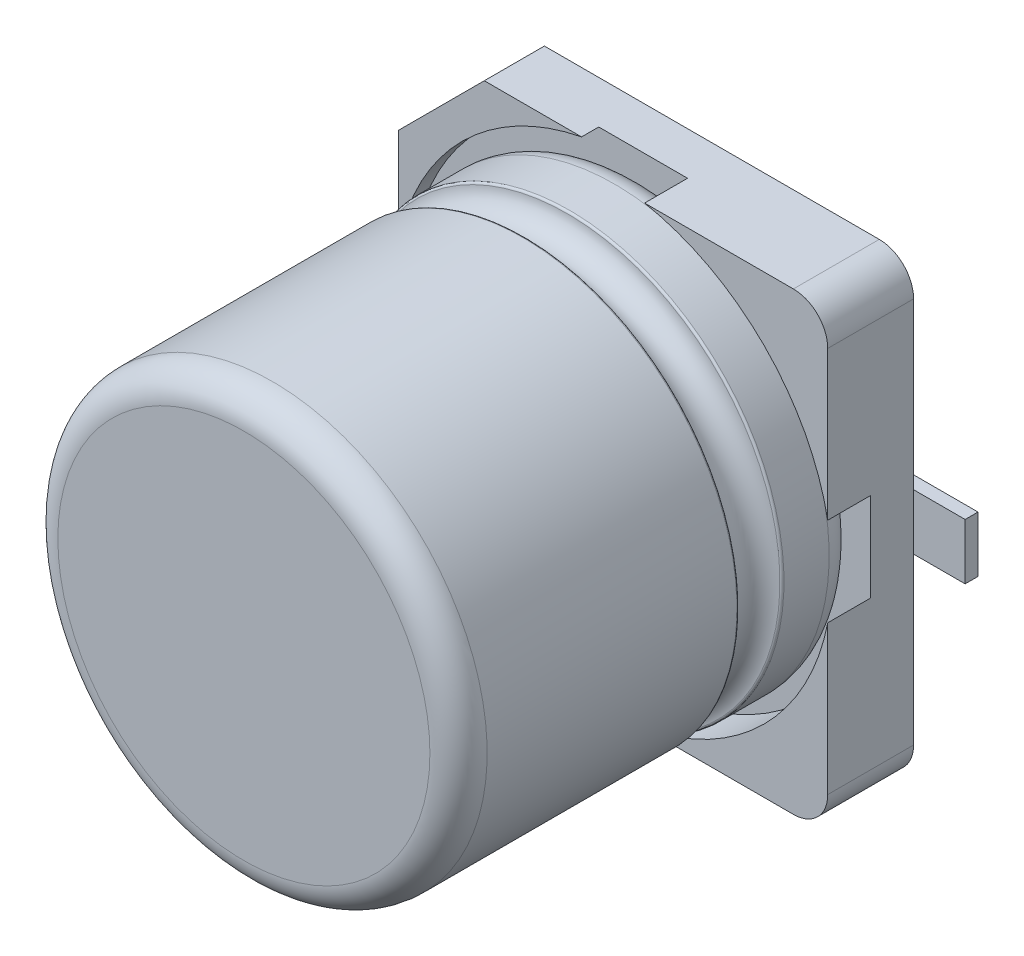
ISO-10303-21;
HEADER;
FILE_DESCRIPTION(('STEP AP214'),'2;1');
FILE_NAME('part.step','',(''),(''),'','','');
FILE_SCHEMA(('AUTOMOTIVE_DESIGN { 1 0 10303 214 1 1 1 1 }'));
ENDSEC;
DATA;
#1=APPLICATION_CONTEXT('core data for automotive mechanical design processes');
#2=APPLICATION_PROTOCOL_DEFINITION('international standard','automotive_design',2000,#1);
#3=PRODUCT_CONTEXT('',#1,'mechanical');
#4=PRODUCT('Part','Part','',(#3));
#5=PRODUCT_RELATED_PRODUCT_CATEGORY('part','',(#4));
#6=PRODUCT_DEFINITION_FORMATION('','',#4);
#7=PRODUCT_DEFINITION_CONTEXT('part definition',#1,'design');
#8=PRODUCT_DEFINITION('design','',#6,#7);
#9=PRODUCT_DEFINITION_SHAPE('','',#8);
#10=(LENGTH_UNIT() NAMED_UNIT(*) SI_UNIT(.MILLI.,.METRE.));
#11=(NAMED_UNIT(*) PLANE_ANGLE_UNIT() SI_UNIT($,.RADIAN.));
#12=(NAMED_UNIT(*) SI_UNIT($,.STERADIAN.) SOLID_ANGLE_UNIT());
#13=UNCERTAINTY_MEASURE_WITH_UNIT(LENGTH_MEASURE(1.E-05),#10,'distance_accuracy_value','');
#14=(GEOMETRIC_REPRESENTATION_CONTEXT(3) GLOBAL_UNCERTAINTY_ASSIGNED_CONTEXT((#13)) GLOBAL_UNIT_ASSIGNED_CONTEXT((#10,
#11,#12)) REPRESENTATION_CONTEXT('',''));
#15=CARTESIAN_POINT('',(0.,0.,0.));
#16=DIRECTION('',(0.,0.,1.));
#17=DIRECTION('',(1.,0.,0.));
#18=AXIS2_PLACEMENT_3D('',#15,#16,#17);
#19=CARTESIAN_POINT('',(0.,0.,5.3));
#20=DIRECTION('',(0.,0.,-1.));
#21=DIRECTION('',(0.,-1.,0.));
#22=AXIS2_PLACEMENT_3D('',#19,#20,#21);
#23=PLANE('',#22);
#24=CARTESIAN_POINT('',(0.,0.,5.30000000001));
#25=DIRECTION('',(0.,0.,-1.));
#26=DIRECTION('',(-1.,0.,0.));
#27=AXIS2_PLACEMENT_3D('',#24,#25,#26);
#28=CIRCLE('',#27,2.1666667);
#29=CARTESIAN_POINT('',(-2.166666666677,1.00002653401398E-11,5.30000000001));
#30=VERTEX_POINT('',#29);
#31=EDGE_CURVE('E11',#30,#30,#28,.T.);
#32=ORIENTED_EDGE('',*,*,#31,.F.);
#33=EDGE_LOOP('',(#32));
#34=FACE_BOUND('',#33,.T.);
#35=ADVANCED_FACE('F17',(#34),#23,.F.);
#36=CARTESIAN_POINT('',(2.072728390536,0.,0.));
#37=DIRECTION('',(0.,0.,1.));
#38=DIRECTION('',(1.,0.,0.));
#39=AXIS2_PLACEMENT_3D('',#36,#37,#38);
#40=PLANE('',#39);
#41=DIRECTION('',(1.,0.,0.));
#42=VECTOR('',#41,1.);
#43=CARTESIAN_POINT('',(1.07500000001,-0.32500000001,0.));
#44=LINE('',#43,#42);
#45=CARTESIAN_POINT('',(1.075,-0.325,0.));
#46=VERTEX_POINT('',#45);
#47=CARTESIAN_POINT('',(3.25,-0.325,0.));
#48=VERTEX_POINT('',#47);
#49=EDGE_CURVE('E545',#46,#48,#44,.T.);
#50=ORIENTED_EDGE('',*,*,#49,.F.);
#51=CARTESIAN_POINT('',(1.07500000001,-1.0000249421274E-11,0.));
#52=DIRECTION('',(0.,0.,1.));
#53=DIRECTION('',(0.,1.,0.));
#54=AXIS2_PLACEMENT_3D('',#51,#52,#53);
#55=CIRCLE('',#54,0.325);
#56=CARTESIAN_POINT('',(1.075,0.325,0.));
#57=VERTEX_POINT('',#56);
#58=EDGE_CURVE('E346',#57,#46,#55,.T.);
#59=ORIENTED_EDGE('',*,*,#58,.F.);
#60=DIRECTION('',(-1.,0.,0.));
#61=VECTOR('',#60,1.);
#62=CARTESIAN_POINT('',(3.25000000001,0.32500000001,0.));
#63=LINE('',#62,#61);
#64=CARTESIAN_POINT('',(3.25,0.325,0.));
#65=VERTEX_POINT('',#64);
#66=EDGE_CURVE('E351',#65,#57,#63,.T.);
#67=ORIENTED_EDGE('',*,*,#66,.F.);
#68=DIRECTION('',(0.,1.,0.));
#69=VECTOR('',#68,1.);
#70=CARTESIAN_POINT('',(3.25000000001,-0.32500000001,0.));
#71=LINE('',#70,#69);
#72=EDGE_CURVE('E30',#48,#65,#71,.T.);
#73=ORIENTED_EDGE('',*,*,#72,.F.);
#74=EDGE_LOOP('',(#50,#59,#67,#73));
#75=FACE_BOUND('',#74,.T.);
#76=ADVANCED_FACE('F677',(#75),#40,.F.);
#77=CARTESIAN_POINT('',(-2.072728390536,0.,0.));
#78=DIRECTION('',(0.,0.,1.));
#79=DIRECTION('',(1.,0.,0.));
#80=AXIS2_PLACEMENT_3D('',#77,#78,#79);
#81=PLANE('',#80);
#82=DIRECTION('',(-1.,0.,0.));
#83=VECTOR('',#82,1.);
#84=CARTESIAN_POINT('',(-1.07500000001,0.32500000001,0.));
#85=LINE('',#84,#83);
#86=CARTESIAN_POINT('',(-1.075,0.325,0.));
#87=VERTEX_POINT('',#86);
#88=CARTESIAN_POINT('',(-3.25,0.325,0.));
#89=VERTEX_POINT('',#88);
#90=EDGE_CURVE('E331',#87,#89,#85,.T.);
#91=ORIENTED_EDGE('',*,*,#90,.F.);
#92=CARTESIAN_POINT('',(-1.07500000001,1.00001177717431E-11,0.));
#93=DIRECTION('',(0.,0.,1.));
#94=DIRECTION('',(0.,-1.,0.));
#95=AXIS2_PLACEMENT_3D('',#92,#93,#94);
#96=CIRCLE('',#95,0.325);
#97=CARTESIAN_POINT('',(-1.075,-0.325,0.));
#98=VERTEX_POINT('',#97);
#99=EDGE_CURVE('E329',#98,#87,#96,.T.);
#100=ORIENTED_EDGE('',*,*,#99,.F.);
#101=DIRECTION('',(1.,0.,0.));
#102=VECTOR('',#101,1.);
#103=CARTESIAN_POINT('',(-3.25000000001,-0.32500000001,0.));
#104=LINE('',#103,#102);
#105=CARTESIAN_POINT('',(-3.25,-0.325,0.));
#106=VERTEX_POINT('',#105);
#107=EDGE_CURVE('E522',#106,#98,#104,.T.);
#108=ORIENTED_EDGE('',*,*,#107,.F.);
#109=DIRECTION('',(0.,-1.,0.));
#110=VECTOR('',#109,1.);
#111=CARTESIAN_POINT('',(-3.25000000001,0.32500000001,0.));
#112=LINE('',#111,#110);
#113=EDGE_CURVE('E472',#89,#106,#112,.T.);
#114=ORIENTED_EDGE('',*,*,#113,.F.);
#115=EDGE_LOOP('',(#91,#100,#108,#114));
#116=FACE_BOUND('',#115,.T.);
#117=ADVANCED_FACE('F500',(#116),#81,.F.);
#118=CARTESIAN_POINT('',(0.,0.,4.966666666667));
#119=DIRECTION('',(0.,0.,1.));
#120=DIRECTION('',(-1.,0.,0.));
#121=AXIS2_PLACEMENT_3D('',#118,#119,#120);
#122=TOROIDAL_SURFACE('',#121,2.1666667,0.3333333);
#123=ORIENTED_EDGE('',*,*,#31,.T.);
#124=EDGE_LOOP('',(#123));
#125=FACE_BOUND('',#124,.T.);
#126=CARTESIAN_POINT('',(0.,0.,4.966666666677));
#127=DIRECTION('',(0.,0.,-1.));
#128=DIRECTION('',(-1.,0.,0.));
#129=AXIS2_PLACEMENT_3D('',#126,#127,#128);
#130=CIRCLE('',#129,2.5);
#131=CARTESIAN_POINT('',(-2.50000000001,1.00003061616998E-11,4.966666666677));
#132=VERTEX_POINT('',#131);
#133=EDGE_CURVE('E623',#132,#132,#130,.T.);
#134=ORIENTED_EDGE('',*,*,#133,.F.);
#135=EDGE_LOOP('',(#134));
#136=FACE_BOUND('',#135,.T.);
#137=ADVANCED_FACE('F691',(#125,#136),#122,.T.);
#138=CARTESIAN_POINT('',(3.25,-0.325,0.));
#139=DIRECTION('',(-1.,0.,0.));
#140=DIRECTION('',(0.,0.,1.));
#141=AXIS2_PLACEMENT_3D('',#138,#139,#140);
#142=PLANE('',#141);
#143=ORIENTED_EDGE('',*,*,#72,.T.);
#144=DIRECTION('',(0.,0.,1.));
#145=VECTOR('',#144,1.);
#146=CARTESIAN_POINT('',(3.25000000001,0.32500000001,0.));
#147=LINE('',#146,#145);
#148=CARTESIAN_POINT('',(3.25,0.325,0.15));
#149=VERTEX_POINT('',#148);
#150=EDGE_CURVE('E181',#65,#149,#147,.T.);
#151=ORIENTED_EDGE('',*,*,#150,.T.);
#152=DIRECTION('',(0.,1.,0.));
#153=VECTOR('',#152,1.);
#154=CARTESIAN_POINT('',(3.25000000001,-0.32500000001,0.15000000001));
#155=LINE('',#154,#153);
#156=CARTESIAN_POINT('',(3.25,-0.325,0.15));
#157=VERTEX_POINT('',#156);
#158=EDGE_CURVE('E468',#157,#149,#155,.T.);
#159=ORIENTED_EDGE('',*,*,#158,.F.);
#160=DIRECTION('',(0.,0.,1.));
#161=VECTOR('',#160,1.);
#162=CARTESIAN_POINT('',(3.25000000001,-0.32500000001,0.));
#163=LINE('',#162,#161);
#164=EDGE_CURVE('E171',#48,#157,#163,.T.);
#165=ORIENTED_EDGE('',*,*,#164,.F.);
#166=EDGE_LOOP('',(#143,#151,#159,#165));
#167=FACE_BOUND('',#166,.T.);
#168=ADVANCED_FACE('F689',(#167),#142,.F.);
#169=CARTESIAN_POINT('',(-3.25,0.325,0.));
#170=DIRECTION('',(1.,0.,0.));
#171=DIRECTION('',(0.,-1.,0.));
#172=AXIS2_PLACEMENT_3D('',#169,#170,#171);
#173=PLANE('',#172);
#174=ORIENTED_EDGE('',*,*,#113,.T.);
#175=DIRECTION('',(0.,0.,1.));
#176=VECTOR('',#175,1.);
#177=CARTESIAN_POINT('',(-3.25000000001,-0.32500000001,0.));
#178=LINE('',#177,#176);
#179=CARTESIAN_POINT('',(-3.25,-0.325,0.15));
#180=VERTEX_POINT('',#179);
#181=EDGE_CURVE('E429',#106,#180,#178,.T.);
#182=ORIENTED_EDGE('',*,*,#181,.T.);
#183=DIRECTION('',(0.,-1.,0.));
#184=VECTOR('',#183,1.);
#185=CARTESIAN_POINT('',(-3.25000000001,0.32500000001,0.15000000001));
#186=LINE('',#185,#184);
#187=CARTESIAN_POINT('',(-3.25,0.325,0.15));
#188=VERTEX_POINT('',#187);
#189=EDGE_CURVE('E382',#188,#180,#186,.T.);
#190=ORIENTED_EDGE('',*,*,#189,.F.);
#191=DIRECTION('',(0.,0.,1.));
#192=VECTOR('',#191,1.);
#193=CARTESIAN_POINT('',(-3.25000000001,0.32500000001,0.));
#194=LINE('',#193,#192);
#195=EDGE_CURVE('E334',#89,#188,#194,.T.);
#196=ORIENTED_EDGE('',*,*,#195,.F.);
#197=EDGE_LOOP('',(#174,#182,#190,#196));
#198=FACE_BOUND('',#197,.T.);
#199=ADVANCED_FACE('F659',(#198),#173,.F.);
#200=CARTESIAN_POINT('',(1.075,-0.325,0.));
#201=DIRECTION('',(0.,1.,0.));
#202=DIRECTION('',(0.,0.,-1.));
#203=AXIS2_PLACEMENT_3D('',#200,#201,#202);
#204=PLANE('',#203);
#205=ORIENTED_EDGE('',*,*,#49,.T.);
#206=ORIENTED_EDGE('',*,*,#164,.T.);
#207=DIRECTION('',(1.,0.,0.));
#208=VECTOR('',#207,1.);
#209=CARTESIAN_POINT('',(1.07500000001,-0.32500000001,0.15000000001));
#210=LINE('',#209,#208);
#211=CARTESIAN_POINT('',(2.65,-0.325,0.15));
#212=VERTEX_POINT('',#211);
#213=EDGE_CURVE('E464',#212,#157,#210,.T.);
#214=ORIENTED_EDGE('',*,*,#213,.F.);
#215=DIRECTION('',(1.,0.,0.));
#216=VECTOR('',#215,1.);
#217=CARTESIAN_POINT('',(1.07500000001,-0.32500000001,0.15000000001));
#218=LINE('',#217,#216);
#219=CARTESIAN_POINT('',(1.075,-0.325,0.15));
#220=VERTEX_POINT('',#219);
#221=EDGE_CURVE('E366',#220,#212,#218,.T.);
#222=ORIENTED_EDGE('',*,*,#221,.F.);
#223=DIRECTION('',(0.,0.,1.));
#224=VECTOR('',#223,1.);
#225=CARTESIAN_POINT('',(1.07500000001,-0.32500000001,0.));
#226=LINE('',#225,#224);
#227=EDGE_CURVE('E350',#46,#220,#226,.T.);
#228=ORIENTED_EDGE('',*,*,#227,.F.);
#229=EDGE_LOOP('',(#205,#206,#214,#222,#228));
#230=FACE_BOUND('',#229,.T.);
#231=ADVANCED_FACE('F796',(#230),#204,.F.);
#232=CARTESIAN_POINT('',(1.075,0.,0.));
#233=DIRECTION('',(0.,0.,1.));
#234=DIRECTION('',(0.,1.,0.));
#235=AXIS2_PLACEMENT_3D('',#232,#233,#234);
#236=CYLINDRICAL_SURFACE('',#235,0.325);
#237=ORIENTED_EDGE('',*,*,#58,.T.);
#238=ORIENTED_EDGE('',*,*,#227,.T.);
#239=CARTESIAN_POINT('',(1.07500000001,-1.0000249421274E-11,0.15000000001));
#240=DIRECTION('',(0.,0.,1.));
#241=DIRECTION('',(0.,1.,0.));
#242=AXIS2_PLACEMENT_3D('',#239,#240,#241);
#243=CIRCLE('',#242,0.325);
#244=CARTESIAN_POINT('',(1.075,0.325,0.15));
#245=VERTEX_POINT('',#244);
#246=EDGE_CURVE('E371',#245,#220,#243,.T.);
#247=ORIENTED_EDGE('',*,*,#246,.F.);
#248=DIRECTION('',(0.,0.,1.));
#249=VECTOR('',#248,1.);
#250=CARTESIAN_POINT('',(1.07500000001,0.32500000001,0.));
#251=LINE('',#250,#249);
#252=EDGE_CURVE('E355',#57,#245,#251,.T.);
#253=ORIENTED_EDGE('',*,*,#252,.F.);
#254=EDGE_LOOP('',(#237,#238,#247,#253));
#255=FACE_BOUND('',#254,.T.);
#256=ADVANCED_FACE('F671',(#255),#236,.T.);
#257=CARTESIAN_POINT('',(3.25,0.325,0.));
#258=DIRECTION('',(0.,-1.,0.));
#259=DIRECTION('',(-1.,0.,0.));
#260=AXIS2_PLACEMENT_3D('',#257,#258,#259);
#261=PLANE('',#260);
#262=ORIENTED_EDGE('',*,*,#66,.T.);
#263=ORIENTED_EDGE('',*,*,#252,.T.);
#264=DIRECTION('',(-1.,0.,0.));
#265=VECTOR('',#264,1.);
#266=CARTESIAN_POINT('',(3.25000000001,0.32500000001,0.15000000001));
#267=LINE('',#266,#265);
#268=CARTESIAN_POINT('',(2.65,0.325,0.15));
#269=VERTEX_POINT('',#268);
#270=EDGE_CURVE('E456',#269,#245,#267,.T.);
#271=ORIENTED_EDGE('',*,*,#270,.F.);
#272=DIRECTION('',(-1.,0.,0.));
#273=VECTOR('',#272,1.);
#274=CARTESIAN_POINT('',(3.25000000001,0.32500000001,0.15000000001));
#275=LINE('',#274,#273);
#276=EDGE_CURVE('E620',#149,#269,#275,.T.);
#277=ORIENTED_EDGE('',*,*,#276,.F.);
#278=ORIENTED_EDGE('',*,*,#150,.F.);
#279=EDGE_LOOP('',(#262,#263,#271,#277,#278));
#280=FACE_BOUND('',#279,.T.);
#281=ADVANCED_FACE('F663',(#280),#261,.F.);
#282=CARTESIAN_POINT('',(-1.075,0.325,0.));
#283=DIRECTION('',(0.,-1.,0.));
#284=DIRECTION('',(-1.,0.,0.));
#285=AXIS2_PLACEMENT_3D('',#282,#283,#284);
#286=PLANE('',#285);
#287=ORIENTED_EDGE('',*,*,#90,.T.);
#288=ORIENTED_EDGE('',*,*,#195,.T.);
#289=DIRECTION('',(-1.,0.,0.));
#290=VECTOR('',#289,1.);
#291=CARTESIAN_POINT('',(-1.07500000001,0.32500000001,0.15000000001));
#292=LINE('',#291,#290);
#293=CARTESIAN_POINT('',(-2.65,0.325,0.15));
#294=VERTEX_POINT('',#293);
#295=EDGE_CURVE('E406',#294,#188,#292,.T.);
#296=ORIENTED_EDGE('',*,*,#295,.F.);
#297=DIRECTION('',(-1.,0.,0.));
#298=VECTOR('',#297,1.);
#299=CARTESIAN_POINT('',(-1.07500000001,0.32500000001,0.15000000001));
#300=LINE('',#299,#298);
#301=CARTESIAN_POINT('',(-1.075,0.325,0.15));
#302=VERTEX_POINT('',#301);
#303=EDGE_CURVE('E300',#302,#294,#300,.T.);
#304=ORIENTED_EDGE('',*,*,#303,.F.);
#305=DIRECTION('',(0.,0.,1.));
#306=VECTOR('',#305,1.);
#307=CARTESIAN_POINT('',(-1.07500000001,0.32500000001,0.));
#308=LINE('',#307,#306);
#309=EDGE_CURVE('E335',#87,#302,#308,.T.);
#310=ORIENTED_EDGE('',*,*,#309,.F.);
#311=EDGE_LOOP('',(#287,#288,#296,#304,#310));
#312=FACE_BOUND('',#311,.T.);
#313=ADVANCED_FACE('F661',(#312),#286,.F.);
#314=CARTESIAN_POINT('',(-1.075,0.,0.));
#315=DIRECTION('',(0.,0.,1.));
#316=DIRECTION('',(0.,-1.,0.));
#317=AXIS2_PLACEMENT_3D('',#314,#315,#316);
#318=CYLINDRICAL_SURFACE('',#317,0.325);
#319=ORIENTED_EDGE('',*,*,#99,.T.);
#320=ORIENTED_EDGE('',*,*,#309,.T.);
#321=CARTESIAN_POINT('',(-1.07500000001,1.00001177717431E-11,0.15000000001));
#322=DIRECTION('',(0.,0.,1.));
#323=DIRECTION('',(0.,-1.,0.));
#324=AXIS2_PLACEMENT_3D('',#321,#322,#323);
#325=CIRCLE('',#324,0.325);
#326=CARTESIAN_POINT('',(-1.075,-0.325,0.15));
#327=VERTEX_POINT('',#326);
#328=EDGE_CURVE('E342',#327,#302,#325,.T.);
#329=ORIENTED_EDGE('',*,*,#328,.F.);
#330=DIRECTION('',(0.,0.,1.));
#331=VECTOR('',#330,1.);
#332=CARTESIAN_POINT('',(-1.07500000001,-0.32500000001,0.));
#333=LINE('',#332,#331);
#334=EDGE_CURVE('E432',#98,#327,#333,.T.);
#335=ORIENTED_EDGE('',*,*,#334,.F.);
#336=EDGE_LOOP('',(#319,#320,#329,#335));
#337=FACE_BOUND('',#336,.T.);
#338=ADVANCED_FACE('F653',(#337),#318,.T.);
#339=CARTESIAN_POINT('',(-3.25,-0.325,0.));
#340=DIRECTION('',(0.,1.,0.));
#341=DIRECTION('',(0.,0.,-1.));
#342=AXIS2_PLACEMENT_3D('',#339,#340,#341);
#343=PLANE('',#342);
#344=ORIENTED_EDGE('',*,*,#107,.T.);
#345=ORIENTED_EDGE('',*,*,#334,.T.);
#346=DIRECTION('',(1.,0.,0.));
#347=VECTOR('',#346,1.);
#348=CARTESIAN_POINT('',(-3.25000000001,-0.32500000001,0.15000000001));
#349=LINE('',#348,#347);
#350=CARTESIAN_POINT('',(-2.65,-0.325,0.15));
#351=VERTEX_POINT('',#350);
#352=EDGE_CURVE('E345',#351,#327,#349,.T.);
#353=ORIENTED_EDGE('',*,*,#352,.F.);
#354=DIRECTION('',(1.,0.,0.));
#355=VECTOR('',#354,1.);
#356=CARTESIAN_POINT('',(-3.25000000001,-0.32500000001,0.15000000001));
#357=LINE('',#356,#355);
#358=EDGE_CURVE('E378',#180,#351,#357,.T.);
#359=ORIENTED_EDGE('',*,*,#358,.F.);
#360=ORIENTED_EDGE('',*,*,#181,.F.);
#361=EDGE_LOOP('',(#344,#345,#353,#359,#360));
#362=FACE_BOUND('',#361,.T.);
#363=ADVANCED_FACE('F643',(#362),#343,.F.);
#364=CARTESIAN_POINT('',(0.,0.,2.033333333333));
#365=DIRECTION('',(0.,0.,-1.));
#366=DIRECTION('',(-1.,0.,0.));
#367=AXIS2_PLACEMENT_3D('',#364,#365,#366);
#368=CYLINDRICAL_SURFACE('',#367,2.5);
#369=ORIENTED_EDGE('',*,*,#133,.T.);
#370=EDGE_LOOP('',(#369));
#371=FACE_BOUND('',#370,.T.);
#372=CARTESIAN_POINT('',(0.,0.,2.05719461208594));
#373=DIRECTION('',(0.,0.,-1.));
#374=DIRECTION('',(-1.,-4.06553765769633E-12,0.));
#375=AXIS2_PLACEMENT_3D('',#372,#373,#374);
#376=CIRCLE('',#375,2.49998919053012);
#377=CARTESIAN_POINT('',(-2.49998936936848,-1.01622350905833E-11,2.057194612086));
#378=VERTEX_POINT('',#377);
#379=EDGE_CURVE('E359',#378,#378,#376,.T.);
#380=ORIENTED_EDGE('',*,*,#379,.F.);
#381=EDGE_LOOP('',(#380));
#382=FACE_BOUND('',#381,.T.);
#383=ADVANCED_FACE('F719',(#371,#382),#368,.T.);
#384=CARTESIAN_POINT('',(2.072728390536,0.,0.15));
#385=DIRECTION('',(0.,0.,1.));
#386=DIRECTION('',(1.,0.,0.));
#387=AXIS2_PLACEMENT_3D('',#384,#385,#386);
#388=PLANE('',#387);
#389=ORIENTED_EDGE('',*,*,#213,.T.);
#390=ORIENTED_EDGE('',*,*,#158,.T.);
#391=ORIENTED_EDGE('',*,*,#276,.T.);
#392=DIRECTION('',(0.,1.,0.));
#393=VECTOR('',#392,1.);
#394=CARTESIAN_POINT('',(2.65000000001,-2.65000000001,0.15000000001));
#395=LINE('',#394,#393);
#396=EDGE_CURVE('E445',#212,#269,#395,.T.);
#397=ORIENTED_EDGE('',*,*,#396,.F.);
#398=EDGE_LOOP('',(#389,#390,#391,#397));
#399=FACE_BOUND('',#398,.T.);
#400=ADVANCED_FACE('F856',(#399),#388,.T.);
#401=CARTESIAN_POINT('',(0.175694359816,0.,1.15));
#402=DIRECTION('',(0.,0.,1.));
#403=DIRECTION('',(0.,-1.,0.));
#404=AXIS2_PLACEMENT_3D('',#401,#402,#403);
#405=PLANE('',#404);
#406=CARTESIAN_POINT('',(2.25000000001,-2.25000000001,1.15000000001));
#407=DIRECTION('',(0.,0.,-1.));
#408=DIRECTION('',(0.,1.,0.));
#409=AXIS2_PLACEMENT_3D('',#406,#407,#408);
#410=CIRCLE('',#409,0.4);
#411=CARTESIAN_POINT('',(2.65,-2.25,1.15));
#412=VERTEX_POINT('',#411);
#413=CARTESIAN_POINT('',(2.25,-2.65,1.15));
#414=VERTEX_POINT('',#413);
#415=EDGE_CURVE('E469',#412,#414,#410,.T.);
#416=ORIENTED_EDGE('',*,*,#415,.F.);
#417=DIRECTION('',(0.,1.,0.));
#418=VECTOR('',#417,1.);
#419=CARTESIAN_POINT('',(2.65000000001,-2.65000000001,1.15000000001));
#420=LINE('',#419,#418);
#421=CARTESIAN_POINT('',(2.65,-0.517204021639,1.15));
#422=VERTEX_POINT('',#421);
#423=EDGE_CURVE('E388',#412,#422,#420,.T.);
#424=ORIENTED_EDGE('',*,*,#423,.T.);
#425=CARTESIAN_POINT('',(0.,0.,1.15000000001));
#426=DIRECTION('',(0.,0.,1.));
#427=DIRECTION('',(-1.,0.,0.));
#428=AXIS2_PLACEMENT_3D('',#425,#426,#427);
#429=CIRCLE('',#428,2.7);
#430=CARTESIAN_POINT('',(0.517204021639,-2.65,1.15));
#431=VERTEX_POINT('',#430);
#432=EDGE_CURVE('E336',#431,#422,#429,.T.);
#433=ORIENTED_EDGE('',*,*,#432,.F.);
#434=DIRECTION('',(1.,0.,0.));
#435=VECTOR('',#434,1.);
#436=CARTESIAN_POINT('',(-1.65000000001,-2.65000000001,1.15000000001));
#437=LINE('',#436,#435);
#438=EDGE_CURVE('E512',#431,#414,#437,.T.);
#439=ORIENTED_EDGE('',*,*,#438,.T.);
#440=EDGE_LOOP('',(#416,#424,#433,#439));
#441=FACE_BOUND('',#440,.T.);
#442=ADVANCED_FACE('F842',(#441),#405,.T.);
#443=CARTESIAN_POINT('',(2.25,-2.25,0.15));
#444=DIRECTION('',(0.,0.,-1.));
#445=DIRECTION('',(1.,0.,0.));
#446=AXIS2_PLACEMENT_3D('',#443,#444,#445);
#447=CYLINDRICAL_SURFACE('',#446,0.4);
#448=DIRECTION('',(0.,0.,1.));
#449=VECTOR('',#448,1.);
#450=CARTESIAN_POINT('',(2.65000000001,-2.25000000001,0.15000000001));
#451=LINE('',#450,#449);
#452=CARTESIAN_POINT('',(2.65,-2.25,0.15));
#453=VERTEX_POINT('',#452);
#454=EDGE_CURVE('E383',#453,#412,#451,.T.);
#455=ORIENTED_EDGE('',*,*,#454,.T.);
#456=ORIENTED_EDGE('',*,*,#415,.T.);
#457=DIRECTION('',(0.,0.,1.));
#458=VECTOR('',#457,1.);
#459=CARTESIAN_POINT('',(2.25000000001,-2.65000000001,0.15000000001));
#460=LINE('',#459,#458);
#461=CARTESIAN_POINT('',(2.25,-2.65,0.15));
#462=VERTEX_POINT('',#461);
#463=EDGE_CURVE('E397',#462,#414,#460,.T.);
#464=ORIENTED_EDGE('',*,*,#463,.F.);
#465=CARTESIAN_POINT('',(2.25000000001,-2.25000000001,0.15000000001));
#466=DIRECTION('',(0.,0.,-1.));
#467=DIRECTION('',(0.,1.,0.));
#468=AXIS2_PLACEMENT_3D('',#465,#466,#467);
#469=CIRCLE('',#468,0.4);
#470=EDGE_CURVE('E370',#453,#462,#469,.T.);
#471=ORIENTED_EDGE('',*,*,#470,.F.);
#472=EDGE_LOOP('',(#455,#456,#464,#471));
#473=FACE_BOUND('',#472,.T.);
#474=ADVANCED_FACE('F502',(#473),#447,.T.);
#475=CARTESIAN_POINT('',(2.25,2.25,0.15));
#476=DIRECTION('',(0.,0.,-1.));
#477=DIRECTION('',(0.,1.,0.));
#478=AXIS2_PLACEMENT_3D('',#475,#476,#477);
#479=CYLINDRICAL_SURFACE('',#478,0.4);
#480=DIRECTION('',(0.,0.,1.));
#481=VECTOR('',#480,1.);
#482=CARTESIAN_POINT('',(2.25000000001,2.65000000001,0.15000000001));
#483=LINE('',#482,#481);
#484=CARTESIAN_POINT('',(2.25,2.65,0.15));
#485=VERTEX_POINT('',#484);
#486=CARTESIAN_POINT('',(2.25,2.65,1.15));
#487=VERTEX_POINT('',#486);
#488=EDGE_CURVE('E541',#485,#487,#483,.T.);
#489=ORIENTED_EDGE('',*,*,#488,.T.);
#490=CARTESIAN_POINT('',(2.25000000001,2.25000000001,1.15000000001));
#491=DIRECTION('',(0.,0.,-1.));
#492=DIRECTION('',(0.,1.,0.));
#493=AXIS2_PLACEMENT_3D('',#490,#491,#492);
#494=CIRCLE('',#493,0.4);
#495=CARTESIAN_POINT('',(2.65,2.25,1.15));
#496=VERTEX_POINT('',#495);
#497=EDGE_CURVE('E416',#487,#496,#494,.T.);
#498=ORIENTED_EDGE('',*,*,#497,.T.);
#499=DIRECTION('',(0.,0.,1.));
#500=VECTOR('',#499,1.);
#501=CARTESIAN_POINT('',(2.65000000001,2.25000000001,0.15000000001));
#502=LINE('',#501,#500);
#503=CARTESIAN_POINT('',(2.65,2.25,0.15));
#504=VERTEX_POINT('',#503);
#505=EDGE_CURVE('E586',#504,#496,#502,.T.);
#506=ORIENTED_EDGE('',*,*,#505,.F.);
#507=CARTESIAN_POINT('',(2.25000000001,2.25000000001,0.15000000001));
#508=DIRECTION('',(0.,0.,-1.));
#509=DIRECTION('',(0.,1.,0.));
#510=AXIS2_PLACEMENT_3D('',#507,#508,#509);
#511=CIRCLE('',#510,0.4);
#512=EDGE_CURVE('E299',#485,#504,#511,.T.);
#513=ORIENTED_EDGE('',*,*,#512,.F.);
#514=EDGE_LOOP('',(#489,#498,#506,#513));
#515=FACE_BOUND('',#514,.T.);
#516=ADVANCED_FACE('F19',(#515),#479,.T.);
#517=CARTESIAN_POINT('',(0.175694359816,0.,1.15));
#518=DIRECTION('',(0.,0.,1.));
#519=DIRECTION('',(0.,-1.,0.));
#520=AXIS2_PLACEMENT_3D('',#517,#518,#519);
#521=PLANE('',#520);
#522=CARTESIAN_POINT('',(0.,0.,1.15000000001));
#523=DIRECTION('',(0.,0.,1.));
#524=DIRECTION('',(-1.,0.,0.));
#525=AXIS2_PLACEMENT_3D('',#522,#523,#524);
#526=CIRCLE('',#525,2.7);
#527=CARTESIAN_POINT('',(2.65,0.517204021639,1.15));
#528=VERTEX_POINT('',#527);
#529=CARTESIAN_POINT('',(0.517204021639,2.65,1.15));
#530=VERTEX_POINT('',#529);
#531=EDGE_CURVE('E341',#528,#530,#526,.T.);
#532=ORIENTED_EDGE('',*,*,#531,.F.);
#533=DIRECTION('',(0.,1.,0.));
#534=VECTOR('',#533,1.);
#535=CARTESIAN_POINT('',(2.65000000001,-2.65000000001,1.15000000001));
#536=LINE('',#535,#534);
#537=EDGE_CURVE('E402',#528,#496,#536,.T.);
#538=ORIENTED_EDGE('',*,*,#537,.T.);
#539=ORIENTED_EDGE('',*,*,#497,.F.);
#540=DIRECTION('',(-1.,0.,0.));
#541=VECTOR('',#540,1.);
#542=CARTESIAN_POINT('',(2.65000000001,2.65000000001,1.15000000001));
#543=LINE('',#542,#541);
#544=EDGE_CURVE('E537',#487,#530,#543,.T.);
#545=ORIENTED_EDGE('',*,*,#544,.T.);
#546=EDGE_LOOP('',(#532,#538,#539,#545));
#547=FACE_BOUND('',#546,.T.);
#548=ADVANCED_FACE('F805',(#547),#521,.T.);
#549=CARTESIAN_POINT('',(0.,2.65,0.85));
#550=DIRECTION('',(0.,0.,1.));
#551=DIRECTION('',(1.,0.,0.));
#552=AXIS2_PLACEMENT_3D('',#549,#550,#551);
#553=PLANE('',#552);
#554=DIRECTION('',(-1.,0.,0.));
#555=VECTOR('',#554,1.);
#556=CARTESIAN_POINT('',(-1.00003245314018E-11,-2.65000000001,0.85000000001));
#557=LINE('',#556,#555);
#558=CARTESIAN_POINT('',(-0.517204021639,-2.65,0.85));
#559=VERTEX_POINT('',#558);
#560=CARTESIAN_POINT('',(-1.65,-2.65,0.85));
#561=VERTEX_POINT('',#560);
#562=EDGE_CURVE('E450',#559,#561,#557,.T.);
#563=ORIENTED_EDGE('',*,*,#562,.F.);
#564=CARTESIAN_POINT('',(0.,0.,0.85000000001));
#565=DIRECTION('',(0.,0.,-1.));
#566=DIRECTION('',(-1.,0.,0.));
#567=AXIS2_PLACEMENT_3D('',#564,#565,#566);
#568=CIRCLE('',#567,2.7);
#569=CARTESIAN_POINT('',(-2.65,-0.517204021639,0.85));
#570=VERTEX_POINT('',#569);
#571=EDGE_CURVE('E412',#559,#570,#568,.T.);
#572=ORIENTED_EDGE('',*,*,#571,.T.);
#573=DIRECTION('',(0.,-1.,0.));
#574=VECTOR('',#573,1.);
#575=CARTESIAN_POINT('',(-2.65000000001,2.65000000001,0.85000000001));
#576=LINE('',#575,#574);
#577=CARTESIAN_POINT('',(-2.65,-1.65,0.85));
#578=VERTEX_POINT('',#577);
#579=EDGE_CURVE('E372',#570,#578,#576,.T.);
#580=ORIENTED_EDGE('',*,*,#579,.T.);
#581=DIRECTION('',(0.707106781186548,-0.707106781186548,0.));
#582=VECTOR('',#581,1.);
#583=CARTESIAN_POINT('',(-3.06250000001,-1.23750000001,0.85000000001));
#584=LINE('',#583,#582);
#585=EDGE_CURVE('E381',#578,#561,#584,.T.);
#586=ORIENTED_EDGE('',*,*,#585,.T.);
#587=EDGE_LOOP('',(#563,#572,#580,#586));
#588=FACE_BOUND('',#587,.T.);
#589=ADVANCED_FACE('F807',(#588),#553,.T.);
#590=CARTESIAN_POINT('',(-2.65,-1.65,0.15));
#591=DIRECTION('',(0.707106781186548,0.707106781186548,0.));
#592=DIRECTION('',(0.,0.,-1.));
#593=AXIS2_PLACEMENT_3D('',#590,#591,#592);
#594=PLANE('',#593);
#595=DIRECTION('',(0.,0.,1.));
#596=VECTOR('',#595,1.);
#597=CARTESIAN_POINT('',(-1.65000000001,-2.65000000001,0.15000000001));
#598=LINE('',#597,#596);
#599=CARTESIAN_POINT('',(-1.65,-2.65,0.15));
#600=VERTEX_POINT('',#599);
#601=EDGE_CURVE('E454',#600,#561,#598,.T.);
#602=ORIENTED_EDGE('',*,*,#601,.T.);
#603=ORIENTED_EDGE('',*,*,#585,.F.);
#604=DIRECTION('',(0.,0.,1.));
#605=VECTOR('',#604,1.);
#606=CARTESIAN_POINT('',(-2.65000000001,-1.65000000001,0.15000000001));
#607=LINE('',#606,#605);
#608=CARTESIAN_POINT('',(-2.65,-1.65,0.15));
#609=VERTEX_POINT('',#608);
#610=EDGE_CURVE('E377',#609,#578,#607,.T.);
#611=ORIENTED_EDGE('',*,*,#610,.F.);
#612=DIRECTION('',(0.707106781186548,-0.707106781186548,0.));
#613=VECTOR('',#612,1.);
#614=CARTESIAN_POINT('',(-2.65000000001,-1.65000000001,0.15000000001));
#615=LINE('',#614,#613);
#616=EDGE_CURVE('E356',#609,#600,#615,.T.);
#617=ORIENTED_EDGE('',*,*,#616,.T.);
#618=EDGE_LOOP('',(#602,#603,#611,#617));
#619=FACE_BOUND('',#618,.T.);
#620=ADVANCED_FACE('F703',(#619),#594,.F.);
#621=CARTESIAN_POINT('',(0.,2.65,0.85));
#622=DIRECTION('',(0.,0.,1.));
#623=DIRECTION('',(1.,0.,0.));
#624=AXIS2_PLACEMENT_3D('',#621,#622,#623);
#625=PLANE('',#624);
#626=CARTESIAN_POINT('',(0.,0.,0.85000000001));
#627=DIRECTION('',(0.,0.,-1.));
#628=DIRECTION('',(-1.,0.,0.));
#629=AXIS2_PLACEMENT_3D('',#626,#627,#628);
#630=CIRCLE('',#629,2.7);
#631=CARTESIAN_POINT('',(-2.65,0.517204021639,0.85));
#632=VERTEX_POINT('',#631);
#633=CARTESIAN_POINT('',(-0.517204021639,2.65,0.85));
#634=VERTEX_POINT('',#633);
#635=EDGE_CURVE('E313',#632,#634,#630,.T.);
#636=ORIENTED_EDGE('',*,*,#635,.T.);
#637=DIRECTION('',(-1.,0.,0.));
#638=VECTOR('',#637,1.);
#639=CARTESIAN_POINT('',(1.00003245314018E-11,2.65000000001,0.85000000001));
#640=LINE('',#639,#638);
#641=CARTESIAN_POINT('',(-1.65,2.65,0.85));
#642=VERTEX_POINT('',#641);
#643=EDGE_CURVE('E549',#634,#642,#640,.T.);
#644=ORIENTED_EDGE('',*,*,#643,.T.);
#645=DIRECTION('',(-0.707106781186548,-0.707106781186548,0.));
#646=VECTOR('',#645,1.);
#647=CARTESIAN_POINT('',(-1.23750000001,3.06250000001,0.85000000001));
#648=LINE('',#647,#646);
#649=CARTESIAN_POINT('',(-2.65,1.65,0.85));
#650=VERTEX_POINT('',#649);
#651=EDGE_CURVE('E462',#642,#650,#648,.T.);
#652=ORIENTED_EDGE('',*,*,#651,.T.);
#653=DIRECTION('',(0.,-1.,0.));
#654=VECTOR('',#653,1.);
#655=CARTESIAN_POINT('',(-2.65000000001,2.65000000001,0.85000000001));
#656=LINE('',#655,#654);
#657=EDGE_CURVE('E318',#650,#632,#656,.T.);
#658=ORIENTED_EDGE('',*,*,#657,.T.);
#659=EDGE_LOOP('',(#636,#644,#652,#658));
#660=FACE_BOUND('',#659,.T.);
#661=ADVANCED_FACE('F687',(#660),#625,.T.);
#662=CARTESIAN_POINT('',(-2.072728390536,0.,0.15));
#663=DIRECTION('',(0.,0.,1.));
#664=DIRECTION('',(1.,0.,0.));
#665=AXIS2_PLACEMENT_3D('',#662,#663,#664);
#666=PLANE('',#665);
#667=ORIENTED_EDGE('',*,*,#295,.T.);
#668=ORIENTED_EDGE('',*,*,#189,.T.);
#669=ORIENTED_EDGE('',*,*,#358,.T.);
#670=DIRECTION('',(0.,-1.,0.));
#671=VECTOR('',#670,1.);
#672=CARTESIAN_POINT('',(-2.65000000001,1.65000000001,0.15000000001));
#673=LINE('',#672,#671);
#674=EDGE_CURVE('E422',#294,#351,#673,.T.);
#675=ORIENTED_EDGE('',*,*,#674,.F.);
#676=EDGE_LOOP('',(#667,#668,#669,#675));
#677=FACE_BOUND('',#676,.T.);
#678=ADVANCED_FACE('F657',(#677),#666,.T.);
#679=CARTESIAN_POINT('',(-1.65,2.65,0.15));
#680=DIRECTION('',(0.707106781186548,-0.707106781186548,0.));
#681=DIRECTION('',(0.,0.,-1.));
#682=AXIS2_PLACEMENT_3D('',#679,#680,#681);
#683=PLANE('',#682);
#684=DIRECTION('',(0.,0.,1.));
#685=VECTOR('',#684,1.);
#686=CARTESIAN_POINT('',(-2.65000000001,1.65000000001,0.15000000001));
#687=LINE('',#686,#685);
#688=CARTESIAN_POINT('',(-2.65,1.65,0.15));
#689=VERTEX_POINT('',#688);
#690=EDGE_CURVE('E291',#689,#650,#687,.T.);
#691=ORIENTED_EDGE('',*,*,#690,.T.);
#692=ORIENTED_EDGE('',*,*,#651,.F.);
#693=DIRECTION('',(0.,0.,1.));
#694=VECTOR('',#693,1.);
#695=CARTESIAN_POINT('',(-1.65000000001,2.65000000001,0.15000000001));
#696=LINE('',#695,#694);
#697=CARTESIAN_POINT('',(-1.65,2.65,0.15));
#698=VERTEX_POINT('',#697);
#699=EDGE_CURVE('E294',#698,#642,#696,.T.);
#700=ORIENTED_EDGE('',*,*,#699,.F.);
#701=DIRECTION('',(-0.707106781186548,-0.707106781186548,0.));
#702=VECTOR('',#701,1.);
#703=CARTESIAN_POINT('',(-1.65000000001,2.65000000001,0.15000000001));
#704=LINE('',#703,#702);
#705=EDGE_CURVE('E287',#698,#689,#704,.T.);
#706=ORIENTED_EDGE('',*,*,#705,.T.);
#707=EDGE_LOOP('',(#691,#692,#700,#706));
#708=FACE_BOUND('',#707,.T.);
#709=ADVANCED_FACE('F289',(#708),#683,.F.);
#710=CARTESIAN_POINT('',(0.175694359816,0.,0.15));
#711=DIRECTION('',(0.,0.,1.));
#712=DIRECTION('',(0.,-1.,0.));
#713=AXIS2_PLACEMENT_3D('',#710,#711,#712);
#714=PLANE('',#713);
#715=DIRECTION('',(1.,0.,0.));
#716=VECTOR('',#715,1.);
#717=CARTESIAN_POINT('',(-1.65000000001,-2.65000000001,0.15000000001));
#718=LINE('',#717,#716);
#719=EDGE_CURVE('E439',#600,#462,#718,.T.);
#720=ORIENTED_EDGE('',*,*,#719,.F.);
#721=ORIENTED_EDGE('',*,*,#616,.F.);
#722=DIRECTION('',(0.,-1.,0.));
#723=VECTOR('',#722,1.);
#724=CARTESIAN_POINT('',(-2.65000000001,1.65000000001,0.15000000001));
#725=LINE('',#724,#723);
#726=EDGE_CURVE('E425',#351,#609,#725,.T.);
#727=ORIENTED_EDGE('',*,*,#726,.F.);
#728=ORIENTED_EDGE('',*,*,#352,.T.);
#729=ORIENTED_EDGE('',*,*,#328,.T.);
#730=ORIENTED_EDGE('',*,*,#303,.T.);
#731=DIRECTION('',(0.,-1.,0.));
#732=VECTOR('',#731,1.);
#733=CARTESIAN_POINT('',(-2.65000000001,1.65000000001,0.15000000001));
#734=LINE('',#733,#732);
#735=EDGE_CURVE('E304',#689,#294,#734,.T.);
#736=ORIENTED_EDGE('',*,*,#735,.F.);
#737=ORIENTED_EDGE('',*,*,#705,.F.);
#738=DIRECTION('',(-1.,0.,0.));
#739=VECTOR('',#738,1.);
#740=CARTESIAN_POINT('',(2.65000000001,2.65000000001,0.15000000001));
#741=LINE('',#740,#739);
#742=EDGE_CURVE('E519',#485,#698,#741,.T.);
#743=ORIENTED_EDGE('',*,*,#742,.F.);
#744=ORIENTED_EDGE('',*,*,#512,.T.);
#745=DIRECTION('',(0.,1.,0.));
#746=VECTOR('',#745,1.);
#747=CARTESIAN_POINT('',(2.65000000001,-2.65000000001,0.15000000001));
#748=LINE('',#747,#746);
#749=EDGE_CURVE('E449',#269,#504,#748,.T.);
#750=ORIENTED_EDGE('',*,*,#749,.F.);
#751=ORIENTED_EDGE('',*,*,#270,.T.);
#752=ORIENTED_EDGE('',*,*,#246,.T.);
#753=ORIENTED_EDGE('',*,*,#221,.T.);
#754=DIRECTION('',(0.,1.,0.));
#755=VECTOR('',#754,1.);
#756=CARTESIAN_POINT('',(2.65000000001,-2.65000000001,0.15000000001));
#757=LINE('',#756,#755);
#758=EDGE_CURVE('E387',#453,#212,#757,.T.);
#759=ORIENTED_EDGE('',*,*,#758,.F.);
#760=ORIENTED_EDGE('',*,*,#470,.T.);
#761=EDGE_LOOP('',(#720,#721,#727,#728,#729,#730,#736,#737,#743,#744,#750,#751,#752,#753,#759,#760));
#762=FACE_BOUND('',#761,.T.);
#763=ADVANCED_FACE('F306',(#762),#714,.F.);
#764=CARTESIAN_POINT('',(2.476863672407,-3.21775086773512E-13,2.0322617684067));
#765=CARTESIAN_POINT('',(2.47706284423898,-3.20048422307637E-13,2.03227995030285));
#766=CARTESIAN_POINT('',(2.47726201607095,-3.18321757841761E-13,2.032298132199));
#767=CARTESIAN_POINT('',(2.49998919053022,-1.2129487829052E-13,2.03437283885669));
#768=CARTESIAN_POINT('',(2.49998919053012,-4.19098349774293E-13,2.057194612086));
#769=(BOUNDED_CURVE() B_SPLINE_CURVE(2,(#764,#765,#766,#767,#768),.UNSPECIFIED.,.F.,
.F.) B_SPLINE_CURVE_WITH_KNOTS((3,2,3),(-0.186390196728678,0.,15.707963267949),
.UNSPECIFIED.) CURVE() GEOMETRIC_REPRESENTATION_ITEM() RATIONAL_B_SPLINE_CURVE((0.999999999999948,
0.999999999999948,0.999999999999948,0.738548945875948,0.999999999999948)) REPRESENTATION_ITEM(''));
#770=CARTESIAN_POINT('',(0.,0.,2.0403396155244));
#771=DIRECTION('',(0.,0.,-1.));
#772=AXIS1_PLACEMENT('',#770,#771);
#773=SURFACE_OF_REVOLUTION('',#769,#772);
#774=ORIENTED_EDGE('',*,*,#379,.T.);
#775=EDGE_LOOP('',(#774));
#776=FACE_BOUND('',#775,.T.);
#777=CARTESIAN_POINT('',(0.,0.,2.032298132209));
#778=DIRECTION('',(0.,0.,-1.));
#779=DIRECTION('',(-1.,0.,0.));
#780=AXIS2_PLACEMENT_3D('',#777,#778,#779);
#781=CIRCLE('',#780,2.4772726);
#782=CARTESIAN_POINT('',(-2.477272727283,1.00003033803628E-11,2.032298132209));
#783=VERTEX_POINT('',#782);
#784=EDGE_CURVE('E393',#783,#783,#781,.T.);
#785=ORIENTED_EDGE('',*,*,#784,.F.);
#786=EDGE_LOOP('',(#785));
#787=FACE_BOUND('',#786,.T.);
#788=ADVANCED_FACE('F488',(#776,#787),#773,.F.);
#789=CARTESIAN_POINT('',(2.65,-2.65,0.15));
#790=DIRECTION('',(-1.,0.,0.));
#791=DIRECTION('',(0.,0.,1.));
#792=AXIS2_PLACEMENT_3D('',#789,#790,#791);
#793=PLANE('',#792);
#794=ORIENTED_EDGE('',*,*,#396,.T.);
#795=ORIENTED_EDGE('',*,*,#749,.T.);
#796=ORIENTED_EDGE('',*,*,#505,.T.);
#797=ORIENTED_EDGE('',*,*,#537,.F.);
#798=DIRECTION('',(0.,0.,-1.));
#799=VECTOR('',#798,1.);
#800=CARTESIAN_POINT('',(2.65000000001,0.517204021649,0.65000000001));
#801=LINE('',#800,#799);
#802=CARTESIAN_POINT('',(2.65,0.517204021639,0.65));
#803=VERTEX_POINT('',#802);
#804=EDGE_CURVE('E394',#528,#803,#801,.T.);
#805=ORIENTED_EDGE('',*,*,#804,.T.);
#806=DIRECTION('',(0.,1.,0.));
#807=VECTOR('',#806,1.);
#808=CARTESIAN_POINT('',(2.65000000001,-1.32500000001,0.65000000001));
#809=LINE('',#808,#807);
#810=CARTESIAN_POINT('',(2.65,-0.517204021639,0.65));
#811=VERTEX_POINT('',#810);
#812=EDGE_CURVE('E365',#811,#803,#809,.T.);
#813=ORIENTED_EDGE('',*,*,#812,.F.);
#814=DIRECTION('',(0.,0.,-1.));
#815=VECTOR('',#814,1.);
#816=CARTESIAN_POINT('',(2.65000000001,-0.517204021649,0.65000000001));
#817=LINE('',#816,#815);
#818=EDGE_CURVE('E340',#422,#811,#817,.T.);
#819=ORIENTED_EDGE('',*,*,#818,.F.);
#820=ORIENTED_EDGE('',*,*,#423,.F.);
#821=ORIENTED_EDGE('',*,*,#454,.F.);
#822=ORIENTED_EDGE('',*,*,#758,.T.);
#823=EDGE_LOOP('',(#794,#795,#796,#797,#805,#813,#819,#820,#821,#822));
#824=FACE_BOUND('',#823,.T.);
#825=ADVANCED_FACE('F499',(#824),#793,.F.);
#826=CARTESIAN_POINT('',(0.,0.,0.65));
#827=DIRECTION('',(0.,0.,1.));
#828=DIRECTION('',(-1.,0.,0.));
#829=AXIS2_PLACEMENT_3D('',#826,#827,#828);
#830=CYLINDRICAL_SURFACE('',#829,2.7);
#831=CARTESIAN_POINT('',(0.,0.,0.65000000001));
#832=DIRECTION('',(0.,0.,1.));
#833=DIRECTION('',(-1.,0.,0.));
#834=AXIS2_PLACEMENT_3D('',#831,#832,#833);
#835=CIRCLE('',#834,2.7);
#836=CARTESIAN_POINT('',(0.517204021639,-2.65,0.65));
#837=VERTEX_POINT('',#836);
#838=EDGE_CURVE('E535',#837,#811,#835,.T.);
#839=ORIENTED_EDGE('',*,*,#838,.F.);
#840=DIRECTION('',(0.,0.,-1.));
#841=VECTOR('',#840,1.);
#842=CARTESIAN_POINT('',(0.517204021649,-2.65000000001,0.65000000001));
#843=LINE('',#842,#841);
#844=EDGE_CURVE('E455',#431,#837,#843,.T.);
#845=ORIENTED_EDGE('',*,*,#844,.F.);
#846=ORIENTED_EDGE('',*,*,#432,.T.);
#847=ORIENTED_EDGE('',*,*,#818,.T.);
#848=EDGE_LOOP('',(#839,#845,#846,#847));
#849=FACE_BOUND('',#848,.T.);
#850=ADVANCED_FACE('F711',(#849),#830,.F.);
#851=CARTESIAN_POINT('',(0.,0.,0.65));
#852=DIRECTION('',(0.,0.,1.));
#853=DIRECTION('',(-1.,0.,0.));
#854=AXIS2_PLACEMENT_3D('',#851,#852,#853);
#855=CYLINDRICAL_SURFACE('',#854,2.7);
#856=DIRECTION('',(0.,0.,-1.));
#857=VECTOR('',#856,1.);
#858=CARTESIAN_POINT('',(0.517204021649,2.65000000001,0.65000000001));
#859=LINE('',#858,#857);
#860=CARTESIAN_POINT('',(0.517204021639,2.65,0.65));
#861=VERTEX_POINT('',#860);
#862=EDGE_CURVE('E542',#530,#861,#859,.T.);
#863=ORIENTED_EDGE('',*,*,#862,.T.);
#864=CARTESIAN_POINT('',(0.,0.,0.65000000001));
#865=DIRECTION('',(0.,0.,1.));
#866=DIRECTION('',(-1.,0.,0.));
#867=AXIS2_PLACEMENT_3D('',#864,#865,#866);
#868=CIRCLE('',#867,2.7);
#869=EDGE_CURVE('E360',#803,#861,#868,.T.);
#870=ORIENTED_EDGE('',*,*,#869,.F.);
#871=ORIENTED_EDGE('',*,*,#804,.F.);
#872=ORIENTED_EDGE('',*,*,#531,.T.);
#873=EDGE_LOOP('',(#863,#870,#871,#872));
#874=FACE_BOUND('',#873,.T.);
#875=ADVANCED_FACE('F801',(#874),#855,.F.);
#876=CARTESIAN_POINT('',(-1.65,-2.65,0.15));
#877=DIRECTION('',(0.,1.,0.));
#878=DIRECTION('',(0.,0.,-1.));
#879=AXIS2_PLACEMENT_3D('',#876,#877,#878);
#880=PLANE('',#879);
#881=ORIENTED_EDGE('',*,*,#438,.F.);
#882=ORIENTED_EDGE('',*,*,#844,.T.);
#883=DIRECTION('',(1.,0.,0.));
#884=VECTOR('',#883,1.);
#885=CARTESIAN_POINT('',(-0.82500000001,-2.65000000001,0.65000000001));
#886=LINE('',#885,#884);
#887=CARTESIAN_POINT('',(-0.517204021639,-2.65,0.65));
#888=VERTEX_POINT('',#887);
#889=EDGE_CURVE('E531',#888,#837,#886,.T.);
#890=ORIENTED_EDGE('',*,*,#889,.F.);
#891=DIRECTION('',(0.,0.,-1.));
#892=VECTOR('',#891,1.);
#893=CARTESIAN_POINT('',(-0.517204021649,-2.65000000001,0.65000000001));
#894=LINE('',#893,#892);
#895=EDGE_CURVE('E555',#559,#888,#894,.T.);
#896=ORIENTED_EDGE('',*,*,#895,.F.);
#897=ORIENTED_EDGE('',*,*,#562,.T.);
#898=ORIENTED_EDGE('',*,*,#601,.F.);
#899=ORIENTED_EDGE('',*,*,#719,.T.);
#900=ORIENTED_EDGE('',*,*,#463,.T.);
#901=EDGE_LOOP('',(#881,#882,#890,#896,#897,#898,#899,#900));
#902=FACE_BOUND('',#901,.T.);
#903=ADVANCED_FACE('F803',(#902),#880,.F.);
#904=CARTESIAN_POINT('',(2.65,2.65,0.15));
#905=DIRECTION('',(0.,-1.,0.));
#906=DIRECTION('',(-1.,0.,0.));
#907=AXIS2_PLACEMENT_3D('',#904,#905,#906);
#908=PLANE('',#907);
#909=ORIENTED_EDGE('',*,*,#699,.T.);
#910=ORIENTED_EDGE('',*,*,#643,.F.);
#911=DIRECTION('',(0.,0.,-1.));
#912=VECTOR('',#911,1.);
#913=CARTESIAN_POINT('',(-0.517204021649,2.65000000001,0.65000000001));
#914=LINE('',#913,#912);
#915=CARTESIAN_POINT('',(-0.517204021639,2.65,0.65));
#916=VERTEX_POINT('',#915);
#917=EDGE_CURVE('E409',#634,#916,#914,.T.);
#918=ORIENTED_EDGE('',*,*,#917,.T.);
#919=DIRECTION('',(-1.,0.,0.));
#920=VECTOR('',#919,1.);
#921=CARTESIAN_POINT('',(1.32500000001,2.65000000001,0.65000000001));
#922=LINE('',#921,#920);
#923=EDGE_CURVE('E364',#861,#916,#922,.T.);
#924=ORIENTED_EDGE('',*,*,#923,.F.);
#925=ORIENTED_EDGE('',*,*,#862,.F.);
#926=ORIENTED_EDGE('',*,*,#544,.F.);
#927=ORIENTED_EDGE('',*,*,#488,.F.);
#928=ORIENTED_EDGE('',*,*,#742,.T.);
#929=EDGE_LOOP('',(#909,#910,#918,#924,#925,#926,#927,#928));
#930=FACE_BOUND('',#929,.T.);
#931=ADVANCED_FACE('F708',(#930),#908,.F.);
#932=CARTESIAN_POINT('',(0.,0.,0.65));
#933=DIRECTION('',(0.,0.,1.));
#934=DIRECTION('',(-1.,0.,0.));
#935=AXIS2_PLACEMENT_3D('',#932,#933,#934);
#936=CYLINDRICAL_SURFACE('',#935,2.7);
#937=CARTESIAN_POINT('',(0.,0.,0.65000000001));
#938=DIRECTION('',(0.,0.,1.));
#939=DIRECTION('',(-1.,0.,0.));
#940=AXIS2_PLACEMENT_3D('',#937,#938,#939);
#941=CIRCLE('',#940,2.7);
#942=CARTESIAN_POINT('',(-2.65,-0.517204021639,0.65));
#943=VERTEX_POINT('',#942);
#944=EDGE_CURVE('E536',#943,#888,#941,.T.);
#945=ORIENTED_EDGE('',*,*,#944,.F.);
#946=DIRECTION('',(0.,0.,-1.));
#947=VECTOR('',#946,1.);
#948=CARTESIAN_POINT('',(-2.65000000001,-0.517204021649,0.65000000001));
#949=LINE('',#948,#947);
#950=EDGE_CURVE('E376',#570,#943,#949,.T.);
#951=ORIENTED_EDGE('',*,*,#950,.F.);
#952=ORIENTED_EDGE('',*,*,#571,.F.);
#953=ORIENTED_EDGE('',*,*,#895,.T.);
#954=EDGE_LOOP('',(#945,#951,#952,#953));
#955=FACE_BOUND('',#954,.T.);
#956=ADVANCED_FACE('F704',(#955),#936,.F.);
#957=CARTESIAN_POINT('',(0.,0.,0.65));
#958=DIRECTION('',(0.,0.,1.));
#959=DIRECTION('',(-1.,0.,0.));
#960=AXIS2_PLACEMENT_3D('',#957,#958,#959);
#961=CYLINDRICAL_SURFACE('',#960,2.7);
#962=ORIENTED_EDGE('',*,*,#635,.F.);
#963=DIRECTION('',(0.,0.,-1.));
#964=VECTOR('',#963,1.);
#965=CARTESIAN_POINT('',(-2.65000000001,0.517204021649,0.65000000001));
#966=LINE('',#965,#964);
#967=CARTESIAN_POINT('',(-2.65,0.517204021639,0.65));
#968=VERTEX_POINT('',#967);
#969=EDGE_CURVE('E325',#632,#968,#966,.T.);
#970=ORIENTED_EDGE('',*,*,#969,.T.);
#971=CARTESIAN_POINT('',(0.,0.,0.65000000001));
#972=DIRECTION('',(0.,0.,1.));
#973=DIRECTION('',(-1.,0.,0.));
#974=AXIS2_PLACEMENT_3D('',#971,#972,#973);
#975=CIRCLE('',#974,2.7);
#976=EDGE_CURVE('E389',#916,#968,#975,.T.);
#977=ORIENTED_EDGE('',*,*,#976,.F.);
#978=ORIENTED_EDGE('',*,*,#917,.F.);
#979=EDGE_LOOP('',(#962,#970,#977,#978));
#980=FACE_BOUND('',#979,.T.);
#981=ADVANCED_FACE('F707',(#980),#961,.F.);
#982=CARTESIAN_POINT('',(-2.65,1.65,0.15));
#983=DIRECTION('',(1.,0.,0.));
#984=DIRECTION('',(0.,-1.,0.));
#985=AXIS2_PLACEMENT_3D('',#982,#983,#984);
#986=PLANE('',#985);
#987=ORIENTED_EDGE('',*,*,#674,.T.);
#988=ORIENTED_EDGE('',*,*,#726,.T.);
#989=ORIENTED_EDGE('',*,*,#610,.T.);
#990=ORIENTED_EDGE('',*,*,#579,.F.);
#991=ORIENTED_EDGE('',*,*,#950,.T.);
#992=DIRECTION('',(0.,-1.,0.));
#993=VECTOR('',#992,1.);
#994=CARTESIAN_POINT('',(-2.65000000001,0.82500000001,0.65000000001));
#995=LINE('',#994,#993);
#996=EDGE_CURVE('E443',#968,#943,#995,.T.);
#997=ORIENTED_EDGE('',*,*,#996,.F.);
#998=ORIENTED_EDGE('',*,*,#969,.F.);
#999=ORIENTED_EDGE('',*,*,#657,.F.);
#1000=ORIENTED_EDGE('',*,*,#690,.F.);
#1001=ORIENTED_EDGE('',*,*,#735,.T.);
#1002=EDGE_LOOP('',(#987,#988,#989,#990,#991,#997,#998,#999,#1000,#1001));
#1003=FACE_BOUND('',#1002,.T.);
#1004=ADVANCED_FACE('F315',(#1003),#986,.F.);
#1005=CARTESIAN_POINT('',(0.,0.,1.783333333343));
#1006=DIRECTION('',(0.,0.,1.));
#1007=DIRECTION('',(1.,0.,0.));
#1008=AXIS2_PLACEMENT_3D('',#1005,#1006,#1007);
#1009=TOROIDAL_SURFACE('',#1008,2.5,0.25);
#1010=ORIENTED_EDGE('',*,*,#784,.T.);
#1011=EDGE_LOOP('',(#1010));
#1012=FACE_BOUND('',#1011,.T.);
#1013=CARTESIAN_POINT('',(0.,0.,1.534368534477));
#1014=DIRECTION('',(0.,0.,-1.));
#1015=DIRECTION('',(-1.,0.,0.));
#1016=AXIS2_PLACEMENT_3D('',#1013,#1014,#1015);
#1017=CIRCLE('',#1016,2.4772726);
#1018=CARTESIAN_POINT('',(-2.477272727283,1.00003033787084E-11,1.534368534477));
#1019=VERTEX_POINT('',#1018);
#1020=EDGE_CURVE('E444',#1019,#1019,#1017,.T.);
#1021=ORIENTED_EDGE('',*,*,#1020,.F.);
#1022=EDGE_LOOP('',(#1021));
#1023=FACE_BOUND('',#1022,.T.);
#1024=ADVANCED_FACE('F954',(#1012,#1023),#1009,.F.);
#1025=CARTESIAN_POINT('',(0.,0.,0.65));
#1026=DIRECTION('',(0.,0.,1.));
#1027=DIRECTION('',(1.,0.,0.));
#1028=AXIS2_PLACEMENT_3D('',#1025,#1026,#1027);
#1029=PLANE('',#1028);
#1030=CARTESIAN_POINT('',(0.,0.,0.65000000001));
#1031=DIRECTION('',(0.,0.,-1.));
#1032=DIRECTION('',(-1.,0.,0.));
#1033=AXIS2_PLACEMENT_3D('',#1030,#1031,#1032);
#1034=CIRCLE('',#1033,2.1666667);
#1035=CARTESIAN_POINT('',(-2.166666666677,1.00002653401398E-11,0.65000000001));
#1036=VERTEX_POINT('',#1035);
#1037=EDGE_CURVE('E440',#1036,#1036,#1034,.T.);
#1038=ORIENTED_EDGE('',*,*,#1037,.T.);
#1039=EDGE_LOOP('',(#1038));
#1040=FACE_BOUND('',#1039,.T.);
#1041=ORIENTED_EDGE('',*,*,#996,.T.);
#1042=ORIENTED_EDGE('',*,*,#944,.T.);
#1043=ORIENTED_EDGE('',*,*,#889,.T.);
#1044=ORIENTED_EDGE('',*,*,#838,.T.);
#1045=ORIENTED_EDGE('',*,*,#812,.T.);
#1046=ORIENTED_EDGE('',*,*,#869,.T.);
#1047=ORIENTED_EDGE('',*,*,#923,.T.);
#1048=ORIENTED_EDGE('',*,*,#976,.T.);
#1049=EDGE_LOOP('',(#1041,#1042,#1043,#1044,#1045,#1046,#1047,#1048));
#1050=FACE_BOUND('',#1049,.T.);
#1051=ADVANCED_FACE('F788',(#1040,#1050),#1029,.T.);
#1052=CARTESIAN_POINT('',(0.,0.,0.983333333333));
#1053=DIRECTION('',(0.,0.,-1.));
#1054=DIRECTION('',(-1.,0.,0.));
#1055=AXIS2_PLACEMENT_3D('',#1052,#1053,#1054);
#1056=TOROIDAL_SURFACE('',#1055,2.1666667,0.3333333);
#1057=ORIENTED_EDGE('',*,*,#1037,.F.);
#1058=EDGE_LOOP('',(#1057));
#1059=FACE_BOUND('',#1058,.T.);
#1060=CARTESIAN_POINT('',(0.,0.,0.983333333343));
#1061=DIRECTION('',(0.,0.,-1.));
#1062=DIRECTION('',(-1.,0.,0.));
#1063=AXIS2_PLACEMENT_3D('',#1060,#1061,#1062);
#1064=CIRCLE('',#1063,2.5);
#1065=CARTESIAN_POINT('',(-2.50000000001,1.00003061616998E-11,0.983333333343));
#1066=VERTEX_POINT('',#1065);
#1067=EDGE_CURVE('E84',#1066,#1066,#1064,.T.);
#1068=ORIENTED_EDGE('',*,*,#1067,.T.);
#1069=EDGE_LOOP('',(#1068));
#1070=FACE_BOUND('',#1069,.T.);
#1071=ADVANCED_FACE('F783',(#1059,#1070),#1056,.T.);
#1072=CARTESIAN_POINT('',(2.49998919053012,-4.09286320113299E-13,1.509472054581));
#1073=CARTESIAN_POINT('',(2.49998919053054,0.,1.53229382781));
#1074=CARTESIAN_POINT('',(2.47726201607081,-2.32561365998153E-13,1.534368534467));
#1075=CARTESIAN_POINT('',(2.47706284423884,-2.34203195085526E-13,1.53438671636314));
#1076=CARTESIAN_POINT('',(2.47686367240686,-2.358450241729E-13,1.53440489825929));
#1077=(BOUNDED_CURVE() B_SPLINE_CURVE(2,(#1072,#1073,#1074,#1075,#1076),.UNSPECIFIED.,.F.,
.F.) B_SPLINE_CURVE_WITH_KNOTS((3,2,3),(0.,15.707963267949,15.8943534646744),
.UNSPECIFIED.) CURVE() GEOMETRIC_REPRESENTATION_ITEM() RATIONAL_B_SPLINE_CURVE((0.999999999999948,
0.738548945876105,0.999999999999948,0.999999999999948,0.999999999999948)) REPRESENTATION_ITEM(''));
#1078=CARTESIAN_POINT('',(0.,0.,1.52632705114225));
#1079=DIRECTION('',(0.,0.,-1.));
#1080=AXIS1_PLACEMENT('',#1078,#1079);
#1081=SURFACE_OF_REVOLUTION('',#1077,#1080);
#1082=ORIENTED_EDGE('',*,*,#1020,.T.);
#1083=EDGE_LOOP('',(#1082));
#1084=FACE_BOUND('',#1083,.T.);
#1085=CARTESIAN_POINT('',(0.,0.,1.509472054581));
#1086=DIRECTION('',(0.,0.,1.));
#1087=DIRECTION('',(-1.,0.,0.));
#1088=AXIS2_PLACEMENT_3D('',#1085,#1086,#1087);
#1089=CIRCLE('',#1088,2.49998919053012);
#1090=CARTESIAN_POINT('',(-2.5,0.,1.509472054581));
#1091=VERTEX_POINT('',#1090);
#1092=EDGE_CURVE('E71',#1091,#1091,#1089,.F.);
#1093=ORIENTED_EDGE('',*,*,#1092,.F.);
#1094=EDGE_LOOP('',(#1093));
#1095=FACE_BOUND('',#1094,.T.);
#1096=ADVANCED_FACE('F718',(#1084,#1095),#1081,.F.);
#1097=CARTESIAN_POINT('',(0.,0.,0.65));
#1098=DIRECTION('',(0.,0.,-1.));
#1099=DIRECTION('',(-1.,0.,0.));
#1100=AXIS2_PLACEMENT_3D('',#1097,#1098,#1099);
#1101=CYLINDRICAL_SURFACE('',#1100,2.5);
#1102=ORIENTED_EDGE('',*,*,#1092,.T.);
#1103=EDGE_LOOP('',(#1102));
#1104=FACE_BOUND('',#1103,.T.);
#1105=ORIENTED_EDGE('',*,*,#1067,.F.);
#1106=EDGE_LOOP('',(#1105));
#1107=FACE_BOUND('',#1106,.T.);
#1108=ADVANCED_FACE('F714',(#1104,#1107),#1101,.T.);
#1109=CLOSED_SHELL('',(#35,#76,#117,#137,#168,#199,#231,#256,#281,#313,#338,#363,#383,#400,#442,
#474,#516,#548,#589,#620,#661,#678,#709,#763,#788,#825,#850,#875,#903,#931,#956,#981,#1004,
#1024,#1051,#1071,#1096,#1108));
#1110=MANIFOLD_SOLID_BREP('B1',#1109);
#1111=ADVANCED_BREP_SHAPE_REPRESENTATION('',(#18,#1110),#14);
#1112=SHAPE_DEFINITION_REPRESENTATION(#9,#1111);
ENDSEC;
END-ISO-10303-21;
